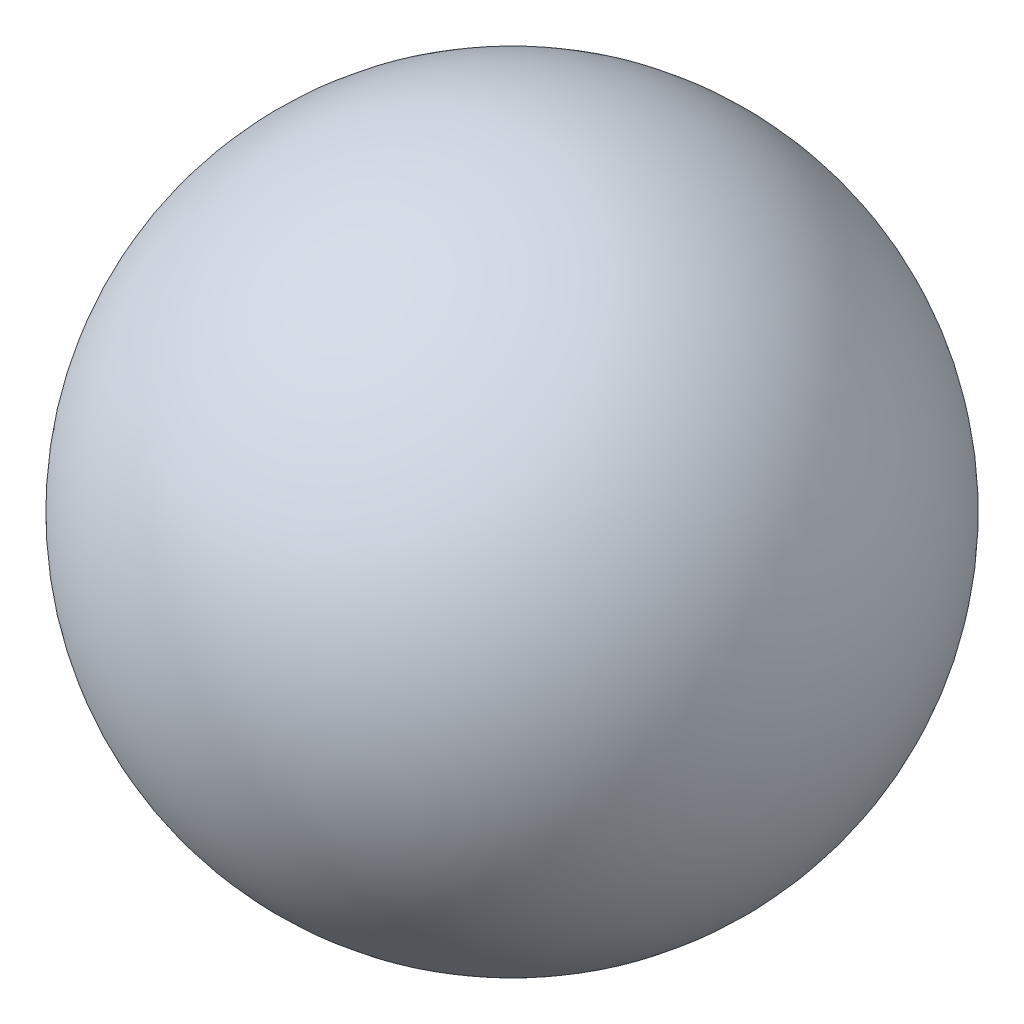
ISO-10303-21;
HEADER;
FILE_DESCRIPTION(('STEP AP214'),'2;1');
FILE_NAME('part.step','',(''),(''),'','','');
FILE_SCHEMA(('AUTOMOTIVE_DESIGN { 1 0 10303 214 1 1 1 1 }'));
ENDSEC;
DATA;
#1=APPLICATION_CONTEXT('core data for automotive mechanical design processes');
#2=APPLICATION_PROTOCOL_DEFINITION('international standard','automotive_design',2000,#1);
#3=PRODUCT_CONTEXT('',#1,'mechanical');
#4=PRODUCT('Part','Part','',(#3));
#5=PRODUCT_RELATED_PRODUCT_CATEGORY('part','',(#4));
#6=PRODUCT_DEFINITION_FORMATION('','',#4);
#7=PRODUCT_DEFINITION_CONTEXT('part definition',#1,'design');
#8=PRODUCT_DEFINITION('design','',#6,#7);
#9=PRODUCT_DEFINITION_SHAPE('','',#8);
#10=(LENGTH_UNIT() NAMED_UNIT(*) SI_UNIT(.MILLI.,.METRE.));
#11=(NAMED_UNIT(*) PLANE_ANGLE_UNIT() SI_UNIT($,.RADIAN.));
#12=(NAMED_UNIT(*) SI_UNIT($,.STERADIAN.) SOLID_ANGLE_UNIT());
#13=UNCERTAINTY_MEASURE_WITH_UNIT(LENGTH_MEASURE(1.E-05),#10,'distance_accuracy_value','');
#14=(GEOMETRIC_REPRESENTATION_CONTEXT(3) GLOBAL_UNCERTAINTY_ASSIGNED_CONTEXT((#13)) GLOBAL_UNIT_ASSIGNED_CONTEXT((#10,
#11,#12)) REPRESENTATION_CONTEXT('',''));
#15=CARTESIAN_POINT('',(0.,0.,0.));
#16=DIRECTION('',(0.,0.,1.));
#17=DIRECTION('',(1.,0.,0.));
#18=AXIS2_PLACEMENT_3D('',#15,#16,#17);
#19=CARTESIAN_POINT('',(0.,0.,0.));
#20=DIRECTION('',(0.,1.,0.));
#21=DIRECTION('',(1.,0.,0.));
#22=AXIS2_PLACEMENT_3D('',#19,#20,#21);
#23=SPHERICAL_SURFACE('',#22,60.745166858458);
#24=CARTESIAN_POINT('',(0.,60.745166858458,0.));
#25=VERTEX_POINT('',#24);
#26=VERTEX_LOOP('',#25);
#27=FACE_BOUND('',#26,.T.);
#28=ADVANCED_FACE('F31',(#27),#23,.T.);
#29=CLOSED_SHELL('',(#28));
#30=MANIFOLD_SOLID_BREP('B2',#29);
#31=ADVANCED_BREP_SHAPE_REPRESENTATION('',(#18,#30),#14);
#32=SHAPE_DEFINITION_REPRESENTATION(#9,#31);
ENDSEC;
END-ISO-10303-21;
